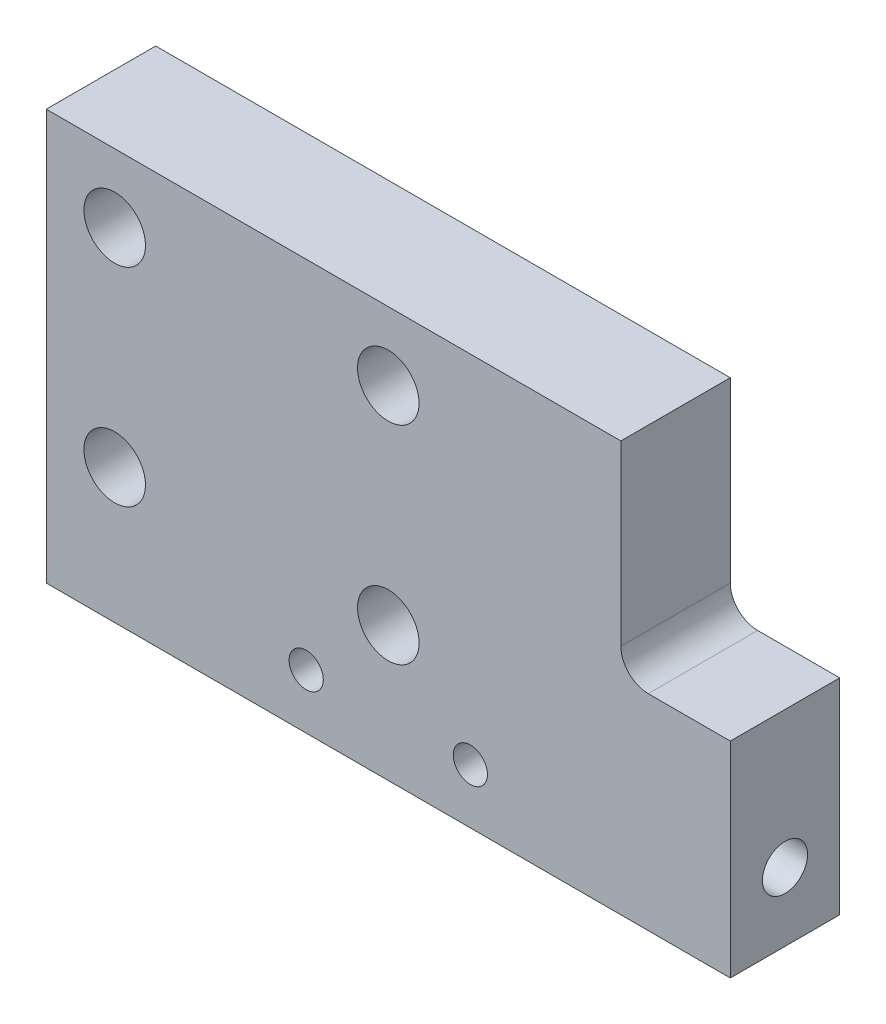
ISO-10303-21;
HEADER;
FILE_DESCRIPTION(('STEP AP214'),'2;1');
FILE_NAME('part.step','',(''),(''),'','','');
FILE_SCHEMA(('AUTOMOTIVE_DESIGN { 1 0 10303 214 1 1 1 1 }'));
ENDSEC;
DATA;
#1=APPLICATION_CONTEXT('core data for automotive mechanical design processes');
#2=APPLICATION_PROTOCOL_DEFINITION('international standard','automotive_design',2000,#1);
#3=PRODUCT_CONTEXT('',#1,'mechanical');
#4=PRODUCT('Part','Part','',(#3));
#5=PRODUCT_RELATED_PRODUCT_CATEGORY('part','',(#4));
#6=PRODUCT_DEFINITION_FORMATION('','',#4);
#7=PRODUCT_DEFINITION_CONTEXT('part definition',#1,'design');
#8=PRODUCT_DEFINITION('design','',#6,#7);
#9=PRODUCT_DEFINITION_SHAPE('','',#8);
#10=(LENGTH_UNIT() NAMED_UNIT(*) SI_UNIT(.MILLI.,.METRE.));
#11=(NAMED_UNIT(*) PLANE_ANGLE_UNIT() SI_UNIT($,.RADIAN.));
#12=(NAMED_UNIT(*) SI_UNIT($,.STERADIAN.) SOLID_ANGLE_UNIT());
#13=UNCERTAINTY_MEASURE_WITH_UNIT(LENGTH_MEASURE(1.E-05),#10,'distance_accuracy_value','');
#14=(GEOMETRIC_REPRESENTATION_CONTEXT(3) GLOBAL_UNCERTAINTY_ASSIGNED_CONTEXT((#13)) GLOBAL_UNIT_ASSIGNED_CONTEXT((#10,
#11,#12)) REPRESENTATION_CONTEXT('',''));
#15=CARTESIAN_POINT('',(0.,0.,0.));
#16=DIRECTION('',(0.,0.,1.));
#17=DIRECTION('',(1.,0.,0.));
#18=AXIS2_PLACEMENT_3D('',#15,#16,#17);
#19=CARTESIAN_POINT('',(0.,0.,8.));
#20=DIRECTION('',(0.,0.,1.));
#21=DIRECTION('',(1.,0.,0.));
#22=AXIS2_PLACEMENT_3D('',#19,#20,#21);
#23=PLANE('',#22);
#24=CARTESIAN_POINT('',(-2.62921348314607,-12.9662921348315,8.));
#25=DIRECTION('',(0.,0.,1.));
#26=DIRECTION('',(1.,0.,0.));
#27=AXIS2_PLACEMENT_3D('',#24,#25,#26);
#28=CIRCLE('',#27,1.25);
#29=CARTESIAN_POINT('',(-1.37921348314607,-12.9662921348315,8.));
#30=VERTEX_POINT('',#29);
#31=EDGE_CURVE('E119',#30,#30,#28,.T.);
#32=ORIENTED_EDGE('',*,*,#31,.F.);
#33=EDGE_LOOP('',(#32));
#34=FACE_BOUND('',#33,.T.);
#35=CARTESIAN_POINT('',(9.37078651685393,-12.9662921348315,8.));
#36=DIRECTION('',(0.,0.,1.));
#37=DIRECTION('',(1.,0.,0.));
#38=AXIS2_PLACEMENT_3D('',#35,#36,#37);
#39=CIRCLE('',#38,1.25);
#40=CARTESIAN_POINT('',(10.6207865168539,-12.9662921348315,8.));
#41=VERTEX_POINT('',#40);
#42=EDGE_CURVE('E126',#41,#41,#39,.T.);
#43=ORIENTED_EDGE('',*,*,#42,.F.);
#44=EDGE_LOOP('',(#43));
#45=FACE_BOUND('',#44,.T.);
#46=CARTESIAN_POINT('',(-16.6292134831461,-7.13483146067416,8.));
#47=DIRECTION('',(0.,0.,1.));
#48=DIRECTION('',(1.,0.,0.));
#49=AXIS2_PLACEMENT_3D('',#46,#47,#48);
#50=CIRCLE('',#49,2.25);
#51=CARTESIAN_POINT('',(-14.3792134831461,-7.13483146067416,8.));
#52=VERTEX_POINT('',#51);
#53=EDGE_CURVE('E140',#52,#52,#50,.T.);
#54=ORIENTED_EDGE('',*,*,#53,.F.);
#55=EDGE_LOOP('',(#54));
#56=FACE_BOUND('',#55,.T.);
#57=CARTESIAN_POINT('',(-16.6292134831461,8.03370786516854,8.));
#58=DIRECTION('',(0.,0.,1.));
#59=DIRECTION('',(1.,0.,0.));
#60=AXIS2_PLACEMENT_3D('',#57,#58,#59);
#61=CIRCLE('',#60,2.25);
#62=CARTESIAN_POINT('',(-14.3792134831461,8.03370786516854,8.));
#63=VERTEX_POINT('',#62);
#64=EDGE_CURVE('E152',#63,#63,#61,.T.);
#65=ORIENTED_EDGE('',*,*,#64,.F.);
#66=EDGE_LOOP('',(#65));
#67=FACE_BOUND('',#66,.T.);
#68=DIRECTION('',(0.,-1.,0.));
#69=VECTOR('',#68,1.);
#70=CARTESIAN_POINT('',(-21.6292134831461,13.0337078651685,8.));
#71=LINE('',#70,#69);
#72=CARTESIAN_POINT('',(-21.6292134831461,13.0337078651685,8.));
#73=VERTEX_POINT('',#72);
#74=CARTESIAN_POINT('',(-21.6292134831461,-16.9662921348315,8.));
#75=VERTEX_POINT('',#74);
#76=EDGE_CURVE('E158',#73,#75,#71,.T.);
#77=ORIENTED_EDGE('',*,*,#76,.T.);
#78=DIRECTION('',(1.,0.,0.));
#79=VECTOR('',#78,1.);
#80=CARTESIAN_POINT('',(-21.6292134831461,-16.9662921348315,8.));
#81=LINE('',#80,#79);
#82=CARTESIAN_POINT('',(28.3707865168539,-16.9662921348315,8.));
#83=VERTEX_POINT('',#82);
#84=EDGE_CURVE('E161',#75,#83,#81,.T.);
#85=ORIENTED_EDGE('',*,*,#84,.T.);
#86=DIRECTION('',(0.,1.,0.));
#87=VECTOR('',#86,1.);
#88=CARTESIAN_POINT('',(28.3707865168539,-1.96629213483146,8.));
#89=LINE('',#88,#87);
#90=CARTESIAN_POINT('',(28.3707865168539,-1.96629213483146,8.));
#91=VERTEX_POINT('',#90);
#92=EDGE_CURVE('E164',#83,#91,#89,.T.);
#93=ORIENTED_EDGE('',*,*,#92,.T.);
#94=DIRECTION('',(-1.,0.,0.));
#95=VECTOR('',#94,1.);
#96=CARTESIAN_POINT('',(20.3707865168539,-1.96629213483146,8.));
#97=LINE('',#96,#95);
#98=CARTESIAN_POINT('',(22.3707865168539,-1.96629213483146,8.));
#99=VERTEX_POINT('',#98);
#100=EDGE_CURVE('E166',#91,#99,#97,.T.);
#101=ORIENTED_EDGE('',*,*,#100,.T.);
#102=CARTESIAN_POINT('',(22.3707865168539,0.0337078651685401,8.));
#103=DIRECTION('',(0.,0.,1.));
#104=DIRECTION('',(1.,0.,0.));
#105=AXIS2_PLACEMENT_3D('',#102,#103,#104);
#106=CIRCLE('',#105,2.);
#107=CARTESIAN_POINT('',(20.3707865168539,0.0337078651685401,8.));
#108=VERTEX_POINT('',#107);
#109=EDGE_CURVE('E11',#99,#108,#106,.F.);
#110=ORIENTED_EDGE('',*,*,#109,.T.);
#111=DIRECTION('',(0.,1.,0.));
#112=VECTOR('',#111,1.);
#113=CARTESIAN_POINT('',(20.3707865168539,13.0337078651685,8.));
#114=LINE('',#113,#112);
#115=CARTESIAN_POINT('',(20.3707865168539,13.0337078651685,8.));
#116=VERTEX_POINT('',#115);
#117=EDGE_CURVE('E168',#108,#116,#114,.T.);
#118=ORIENTED_EDGE('',*,*,#117,.T.);
#119=DIRECTION('',(-1.,0.,0.));
#120=VECTOR('',#119,1.);
#121=CARTESIAN_POINT('',(-21.6292134831461,13.0337078651685,8.));
#122=LINE('',#121,#120);
#123=EDGE_CURVE('E170',#116,#73,#122,.T.);
#124=ORIENTED_EDGE('',*,*,#123,.T.);
#125=EDGE_LOOP('',(#77,#85,#93,#101,#110,#118,#124));
#126=FACE_BOUND('',#125,.T.);
#127=CARTESIAN_POINT('',(3.37078651685392,8.03370786516854,8.));
#128=DIRECTION('',(0.,0.,1.));
#129=DIRECTION('',(1.,0.,0.));
#130=AXIS2_PLACEMENT_3D('',#127,#128,#129);
#131=CIRCLE('',#130,2.25);
#132=CARTESIAN_POINT('',(5.62078651685392,8.03370786516854,8.));
#133=VERTEX_POINT('',#132);
#134=EDGE_CURVE('E146',#133,#133,#131,.T.);
#135=ORIENTED_EDGE('',*,*,#134,.F.);
#136=EDGE_LOOP('',(#135));
#137=FACE_BOUND('',#136,.T.);
#138=CARTESIAN_POINT('',(3.37078651685392,-7.13483146067416,8.));
#139=DIRECTION('',(0.,0.,1.));
#140=DIRECTION('',(1.,0.,0.));
#141=AXIS2_PLACEMENT_3D('',#138,#139,#140);
#142=CIRCLE('',#141,2.25);
#143=CARTESIAN_POINT('',(5.62078651685392,-7.13483146067416,8.));
#144=VERTEX_POINT('',#143);
#145=EDGE_CURVE('E133',#144,#144,#142,.T.);
#146=ORIENTED_EDGE('',*,*,#145,.F.);
#147=EDGE_LOOP('',(#146));
#148=FACE_BOUND('',#147,.T.);
#149=ADVANCED_FACE('F35',(#34,#45,#56,#67,#126,#137,#148),#23,.T.);
#150=CARTESIAN_POINT('',(0.,0.,0.));
#151=DIRECTION('',(0.,0.,1.));
#152=DIRECTION('',(1.,0.,0.));
#153=AXIS2_PLACEMENT_3D('',#150,#151,#152);
#154=PLANE('',#153);
#155=CARTESIAN_POINT('',(-2.62921348314607,-12.9662921348315,0.));
#156=DIRECTION('',(0.,0.,1.));
#157=DIRECTION('',(1.,0.,0.));
#158=AXIS2_PLACEMENT_3D('',#155,#156,#157);
#159=CIRCLE('',#158,0.41786025882474);
#160=CARTESIAN_POINT('',(-2.21135322432133,-12.9662921348315,0.));
#161=VERTEX_POINT('',#160);
#162=EDGE_CURVE('E125',#161,#161,#159,.T.);
#163=ORIENTED_EDGE('',*,*,#162,.T.);
#164=EDGE_LOOP('',(#163));
#165=FACE_BOUND('',#164,.T.);
#166=CARTESIAN_POINT('',(9.37078651685393,-12.9662921348315,0.));
#167=DIRECTION('',(0.,0.,1.));
#168=DIRECTION('',(1.,0.,0.));
#169=AXIS2_PLACEMENT_3D('',#166,#167,#168);
#170=CIRCLE('',#169,0.41786025882474);
#171=CARTESIAN_POINT('',(9.78864677567867,-12.9662921348315,0.));
#172=VERTEX_POINT('',#171);
#173=EDGE_CURVE('E132',#172,#172,#170,.T.);
#174=ORIENTED_EDGE('',*,*,#173,.T.);
#175=EDGE_LOOP('',(#174));
#176=FACE_BOUND('',#175,.T.);
#177=DIRECTION('',(0.,-1.,0.));
#178=VECTOR('',#177,1.);
#179=CARTESIAN_POINT('',(-21.6292134831461,13.0337078651685,0.));
#180=LINE('',#179,#178);
#181=CARTESIAN_POINT('',(-21.6292134831461,13.0337078651685,0.));
#182=VERTEX_POINT('',#181);
#183=CARTESIAN_POINT('',(-21.6292134831461,-16.9662921348315,0.));
#184=VERTEX_POINT('',#183);
#185=EDGE_CURVE('E155',#182,#184,#180,.T.);
#186=ORIENTED_EDGE('',*,*,#185,.F.);
#187=DIRECTION('',(-1.,0.,0.));
#188=VECTOR('',#187,1.);
#189=CARTESIAN_POINT('',(-21.6292134831461,13.0337078651685,0.));
#190=LINE('',#189,#188);
#191=CARTESIAN_POINT('',(20.3707865168539,13.0337078651685,0.));
#192=VERTEX_POINT('',#191);
#193=EDGE_CURVE('E162',#192,#182,#190,.T.);
#194=ORIENTED_EDGE('',*,*,#193,.F.);
#195=DIRECTION('',(0.,1.,0.));
#196=VECTOR('',#195,1.);
#197=CARTESIAN_POINT('',(20.3707865168539,13.0337078651685,0.));
#198=LINE('',#197,#196);
#199=CARTESIAN_POINT('',(20.3707865168539,0.0337078651685401,0.));
#200=VERTEX_POINT('',#199);
#201=EDGE_CURVE('E181',#200,#192,#198,.T.);
#202=ORIENTED_EDGE('',*,*,#201,.F.);
#203=CARTESIAN_POINT('',(22.3707865168539,0.0337078651685401,0.));
#204=DIRECTION('',(0.,0.,1.));
#205=DIRECTION('',(1.,0.,0.));
#206=AXIS2_PLACEMENT_3D('',#203,#204,#205);
#207=CIRCLE('',#206,2.);
#208=CARTESIAN_POINT('',(22.3707865168539,-1.96629213483146,0.));
#209=VERTEX_POINT('',#208);
#210=EDGE_CURVE('E43',#200,#209,#207,.T.);
#211=ORIENTED_EDGE('',*,*,#210,.T.);
#212=DIRECTION('',(-1.,0.,0.));
#213=VECTOR('',#212,1.);
#214=CARTESIAN_POINT('',(20.3707865168539,-1.96629213483146,0.));
#215=LINE('',#214,#213);
#216=CARTESIAN_POINT('',(28.3707865168539,-1.96629213483146,0.));
#217=VERTEX_POINT('',#216);
#218=EDGE_CURVE('E179',#217,#209,#215,.T.);
#219=ORIENTED_EDGE('',*,*,#218,.F.);
#220=DIRECTION('',(0.,1.,0.));
#221=VECTOR('',#220,1.);
#222=CARTESIAN_POINT('',(28.3707865168539,-1.96629213483146,0.));
#223=LINE('',#222,#221);
#224=CARTESIAN_POINT('',(28.3707865168539,-16.9662921348315,0.));
#225=VERTEX_POINT('',#224);
#226=EDGE_CURVE('E177',#225,#217,#223,.T.);
#227=ORIENTED_EDGE('',*,*,#226,.F.);
#228=DIRECTION('',(1.,0.,0.));
#229=VECTOR('',#228,1.);
#230=CARTESIAN_POINT('',(-21.6292134831461,-16.9662921348315,0.));
#231=LINE('',#230,#229);
#232=EDGE_CURVE('E175',#184,#225,#231,.T.);
#233=ORIENTED_EDGE('',*,*,#232,.F.);
#234=EDGE_LOOP('',(#186,#194,#202,#211,#219,#227,#233));
#235=FACE_BOUND('',#234,.T.);
#236=CARTESIAN_POINT('',(-16.6292134831461,8.03370786516854,0.));
#237=DIRECTION('',(0.,0.,1.));
#238=DIRECTION('',(1.,0.,0.));
#239=AXIS2_PLACEMENT_3D('',#236,#237,#238);
#240=CIRCLE('',#239,2.25);
#241=CARTESIAN_POINT('',(-14.3792134831461,8.03370786516854,0.));
#242=VERTEX_POINT('',#241);
#243=EDGE_CURVE('E149',#242,#242,#240,.T.);
#244=ORIENTED_EDGE('',*,*,#243,.T.);
#245=EDGE_LOOP('',(#244));
#246=FACE_BOUND('',#245,.T.);
#247=CARTESIAN_POINT('',(3.37078651685392,8.03370786516854,0.));
#248=DIRECTION('',(0.,0.,1.));
#249=DIRECTION('',(1.,0.,0.));
#250=AXIS2_PLACEMENT_3D('',#247,#248,#249);
#251=CIRCLE('',#250,2.25);
#252=CARTESIAN_POINT('',(5.62078651685392,8.03370786516854,0.));
#253=VERTEX_POINT('',#252);
#254=EDGE_CURVE('E143',#253,#253,#251,.T.);
#255=ORIENTED_EDGE('',*,*,#254,.T.);
#256=EDGE_LOOP('',(#255));
#257=FACE_BOUND('',#256,.T.);
#258=CARTESIAN_POINT('',(-16.6292134831461,-7.13483146067416,0.));
#259=DIRECTION('',(0.,0.,1.));
#260=DIRECTION('',(1.,0.,0.));
#261=AXIS2_PLACEMENT_3D('',#258,#259,#260);
#262=CIRCLE('',#261,2.25);
#263=CARTESIAN_POINT('',(-14.3792134831461,-7.13483146067416,0.));
#264=VERTEX_POINT('',#263);
#265=EDGE_CURVE('E136',#264,#264,#262,.T.);
#266=ORIENTED_EDGE('',*,*,#265,.T.);
#267=EDGE_LOOP('',(#266));
#268=FACE_BOUND('',#267,.T.);
#269=CARTESIAN_POINT('',(3.37078651685392,-7.13483146067416,0.));
#270=DIRECTION('',(0.,0.,1.));
#271=DIRECTION('',(1.,0.,0.));
#272=AXIS2_PLACEMENT_3D('',#269,#270,#271);
#273=CIRCLE('',#272,2.25);
#274=CARTESIAN_POINT('',(5.62078651685392,-7.13483146067416,0.));
#275=VERTEX_POINT('',#274);
#276=EDGE_CURVE('E137',#275,#275,#273,.T.);
#277=ORIENTED_EDGE('',*,*,#276,.T.);
#278=EDGE_LOOP('',(#277));
#279=FACE_BOUND('',#278,.T.);
#280=ADVANCED_FACE('F214',(#165,#176,#235,#246,#257,#268,#279),#154,.F.);
#281=CARTESIAN_POINT('',(-21.6292134831461,13.0337078651685,8.));
#282=DIRECTION('',(1.,0.,0.));
#283=DIRECTION('',(0.,1.,0.));
#284=AXIS2_PLACEMENT_3D('',#281,#282,#283);
#285=PLANE('',#284);
#286=CARTESIAN_POINT('',(-21.6292134831461,-11.9662921348315,4.));
#287=DIRECTION('',(-1.,0.,0.));
#288=DIRECTION('',(0.,0.,1.));
#289=AXIS2_PLACEMENT_3D('',#286,#287,#288);
#290=CIRCLE('',#289,1.64999999999999);
#291=CARTESIAN_POINT('',(-21.6292134831461,-11.9662921348315,5.64999999999999));
#292=VERTEX_POINT('',#291);
#293=EDGE_CURVE('E109',#292,#292,#290,.T.);
#294=ORIENTED_EDGE('',*,*,#293,.F.);
#295=EDGE_LOOP('',(#294));
#296=FACE_BOUND('',#295,.T.);
#297=ORIENTED_EDGE('',*,*,#185,.T.);
#298=DIRECTION('',(0.,0.,-1.));
#299=VECTOR('',#298,1.);
#300=CARTESIAN_POINT('',(-21.6292134831461,-16.9662921348315,8.));
#301=LINE('',#300,#299);
#302=EDGE_CURVE('E195',#75,#184,#301,.T.);
#303=ORIENTED_EDGE('',*,*,#302,.F.);
#304=ORIENTED_EDGE('',*,*,#76,.F.);
#305=DIRECTION('',(0.,0.,-1.));
#306=VECTOR('',#305,1.);
#307=CARTESIAN_POINT('',(-21.6292134831461,13.0337078651685,8.));
#308=LINE('',#307,#306);
#309=EDGE_CURVE('E172',#73,#182,#308,.T.);
#310=ORIENTED_EDGE('',*,*,#309,.T.);
#311=EDGE_LOOP('',(#297,#303,#304,#310));
#312=FACE_BOUND('',#311,.T.);
#313=ADVANCED_FACE('F222',(#296,#312),#285,.F.);
#314=CARTESIAN_POINT('',(-21.6292134831461,-16.9662921348315,8.));
#315=DIRECTION('',(0.,1.,0.));
#316=DIRECTION('',(0.,0.,1.));
#317=AXIS2_PLACEMENT_3D('',#314,#315,#316);
#318=PLANE('',#317);
#319=ORIENTED_EDGE('',*,*,#232,.T.);
#320=DIRECTION('',(0.,0.,-1.));
#321=VECTOR('',#320,1.);
#322=CARTESIAN_POINT('',(28.3707865168539,-16.9662921348315,8.));
#323=LINE('',#322,#321);
#324=EDGE_CURVE('E192',#83,#225,#323,.T.);
#325=ORIENTED_EDGE('',*,*,#324,.F.);
#326=ORIENTED_EDGE('',*,*,#84,.F.);
#327=ORIENTED_EDGE('',*,*,#302,.T.);
#328=EDGE_LOOP('',(#319,#325,#326,#327));
#329=FACE_BOUND('',#328,.T.);
#330=ADVANCED_FACE('F256',(#329),#318,.F.);
#331=CARTESIAN_POINT('',(28.3707865168539,-1.96629213483146,8.));
#332=DIRECTION('',(-1.,0.,0.));
#333=DIRECTION('',(0.,-1.,0.));
#334=AXIS2_PLACEMENT_3D('',#331,#332,#333);
#335=PLANE('',#334);
#336=CARTESIAN_POINT('',(28.3707865168539,-11.9662921348315,4.));
#337=DIRECTION('',(1.,0.,0.));
#338=DIRECTION('',(0.,0.,-1.));
#339=AXIS2_PLACEMENT_3D('',#336,#337,#338);
#340=CIRCLE('',#339,1.65);
#341=CARTESIAN_POINT('',(28.3707865168539,-11.9662921348315,2.35));
#342=VERTEX_POINT('',#341);
#343=EDGE_CURVE('E108',#342,#342,#340,.T.);
#344=ORIENTED_EDGE('',*,*,#343,.F.);
#345=EDGE_LOOP('',(#344));
#346=FACE_BOUND('',#345,.T.);
#347=ORIENTED_EDGE('',*,*,#226,.T.);
#348=DIRECTION('',(0.,0.,-1.));
#349=VECTOR('',#348,1.);
#350=CARTESIAN_POINT('',(28.3707865168539,-1.96629213483146,8.));
#351=LINE('',#350,#349);
#352=EDGE_CURVE('E189',#91,#217,#351,.T.);
#353=ORIENTED_EDGE('',*,*,#352,.F.);
#354=ORIENTED_EDGE('',*,*,#92,.F.);
#355=ORIENTED_EDGE('',*,*,#324,.T.);
#356=EDGE_LOOP('',(#347,#353,#354,#355));
#357=FACE_BOUND('',#356,.T.);
#358=ADVANCED_FACE('F253',(#346,#357),#335,.F.);
#359=CARTESIAN_POINT('',(20.3707865168539,-1.96629213483146,8.));
#360=DIRECTION('',(0.,-1.,0.));
#361=DIRECTION('',(1.,0.,0.));
#362=AXIS2_PLACEMENT_3D('',#359,#360,#361);
#363=PLANE('',#362);
#364=ORIENTED_EDGE('',*,*,#218,.T.);
#365=DIRECTION('',(0.,0.,-1.));
#366=VECTOR('',#365,1.);
#367=CARTESIAN_POINT('',(22.3707865168539,-1.96629213483146,8.));
#368=LINE('',#367,#366);
#369=EDGE_CURVE('E50',#209,#99,#368,.F.);
#370=ORIENTED_EDGE('',*,*,#369,.T.);
#371=ORIENTED_EDGE('',*,*,#100,.F.);
#372=ORIENTED_EDGE('',*,*,#352,.T.);
#373=EDGE_LOOP('',(#364,#370,#371,#372));
#374=FACE_BOUND('',#373,.T.);
#375=ADVANCED_FACE('F250',(#374),#363,.F.);
#376=CARTESIAN_POINT('',(20.3707865168539,13.0337078651685,8.));
#377=DIRECTION('',(-1.,0.,0.));
#378=DIRECTION('',(0.,0.,1.));
#379=AXIS2_PLACEMENT_3D('',#376,#377,#378);
#380=PLANE('',#379);
#381=ORIENTED_EDGE('',*,*,#117,.F.);
#382=DIRECTION('',(0.,0.,-1.));
#383=VECTOR('',#382,1.);
#384=CARTESIAN_POINT('',(20.3707865168539,0.0337078651685401,0.));
#385=LINE('',#384,#383);
#386=EDGE_CURVE('E198',#108,#200,#385,.T.);
#387=ORIENTED_EDGE('',*,*,#386,.T.);
#388=ORIENTED_EDGE('',*,*,#201,.T.);
#389=DIRECTION('',(0.,0.,-1.));
#390=VECTOR('',#389,1.);
#391=CARTESIAN_POINT('',(20.3707865168539,13.0337078651685,8.));
#392=LINE('',#391,#390);
#393=EDGE_CURVE('E186',#116,#192,#392,.T.);
#394=ORIENTED_EDGE('',*,*,#393,.F.);
#395=EDGE_LOOP('',(#381,#387,#388,#394));
#396=FACE_BOUND('',#395,.T.);
#397=ADVANCED_FACE('F208',(#396),#380,.F.);
#398=CARTESIAN_POINT('',(-21.6292134831461,13.0337078651685,8.));
#399=DIRECTION('',(0.,-1.,0.));
#400=DIRECTION('',(0.,0.,-1.));
#401=AXIS2_PLACEMENT_3D('',#398,#399,#400);
#402=PLANE('',#401);
#403=ORIENTED_EDGE('',*,*,#193,.T.);
#404=ORIENTED_EDGE('',*,*,#309,.F.);
#405=ORIENTED_EDGE('',*,*,#123,.F.);
#406=ORIENTED_EDGE('',*,*,#393,.T.);
#407=EDGE_LOOP('',(#403,#404,#405,#406));
#408=FACE_BOUND('',#407,.T.);
#409=ADVANCED_FACE('F218',(#408),#402,.F.);
#410=CARTESIAN_POINT('',(-16.6292134831461,8.03370786516854,8.));
#411=DIRECTION('',(0.,0.,-1.));
#412=DIRECTION('',(-1.,0.,0.));
#413=AXIS2_PLACEMENT_3D('',#410,#411,#412);
#414=CYLINDRICAL_SURFACE('',#413,2.25);
#415=ORIENTED_EDGE('',*,*,#64,.T.);
#416=EDGE_LOOP('',(#415));
#417=FACE_BOUND('',#416,.T.);
#418=ORIENTED_EDGE('',*,*,#243,.F.);
#419=EDGE_LOOP('',(#418));
#420=FACE_BOUND('',#419,.T.);
#421=ADVANCED_FACE('F243',(#417,#420),#414,.F.);
#422=CARTESIAN_POINT('',(3.37078651685392,8.03370786516854,8.));
#423=DIRECTION('',(0.,0.,-1.));
#424=DIRECTION('',(-1.,0.,0.));
#425=AXIS2_PLACEMENT_3D('',#422,#423,#424);
#426=CYLINDRICAL_SURFACE('',#425,2.25);
#427=ORIENTED_EDGE('',*,*,#134,.T.);
#428=EDGE_LOOP('',(#427));
#429=FACE_BOUND('',#428,.T.);
#430=ORIENTED_EDGE('',*,*,#254,.F.);
#431=EDGE_LOOP('',(#430));
#432=FACE_BOUND('',#431,.T.);
#433=ADVANCED_FACE('F298',(#429,#432),#426,.F.);
#434=CARTESIAN_POINT('',(-16.6292134831461,-7.13483146067416,8.));
#435=DIRECTION('',(0.,0.,-1.));
#436=DIRECTION('',(-1.,0.,0.));
#437=AXIS2_PLACEMENT_3D('',#434,#435,#436);
#438=CYLINDRICAL_SURFACE('',#437,2.25);
#439=ORIENTED_EDGE('',*,*,#53,.T.);
#440=EDGE_LOOP('',(#439));
#441=FACE_BOUND('',#440,.T.);
#442=ORIENTED_EDGE('',*,*,#265,.F.);
#443=EDGE_LOOP('',(#442));
#444=FACE_BOUND('',#443,.T.);
#445=ADVANCED_FACE('F305',(#441,#444),#438,.F.);
#446=CARTESIAN_POINT('',(3.37078651685392,-7.13483146067416,8.));
#447=DIRECTION('',(0.,0.,-1.));
#448=DIRECTION('',(-1.,0.,0.));
#449=AXIS2_PLACEMENT_3D('',#446,#447,#448);
#450=CYLINDRICAL_SURFACE('',#449,2.25);
#451=ORIENTED_EDGE('',*,*,#145,.T.);
#452=EDGE_LOOP('',(#451));
#453=FACE_BOUND('',#452,.T.);
#454=ORIENTED_EDGE('',*,*,#276,.F.);
#455=EDGE_LOOP('',(#454));
#456=FACE_BOUND('',#455,.T.);
#457=ADVANCED_FACE('F312',(#453,#456),#450,.F.);
#458=CARTESIAN_POINT('',(9.37078651685393,-12.9662921348315,0.5));
#459=DIRECTION('',(0.,0.,1.));
#460=DIRECTION('',(1.,0.,0.));
#461=AXIS2_PLACEMENT_3D('',#458,#459,#460);
#462=CONICAL_SURFACE('',#461,1.25,1.02974425867665);
#463=CARTESIAN_POINT('',(9.37078651685393,-12.9662921348315,0.5));
#464=DIRECTION('',(0.,0.,1.));
#465=DIRECTION('',(1.,0.,0.));
#466=AXIS2_PLACEMENT_3D('',#463,#464,#465);
#467=CIRCLE('',#466,1.25);
#468=CARTESIAN_POINT('',(10.6207865168539,-12.9662921348315,0.5));
#469=VERTEX_POINT('',#468);
#470=EDGE_CURVE('E129',#469,#469,#467,.T.);
#471=ORIENTED_EDGE('',*,*,#470,.T.);
#472=EDGE_LOOP('',(#471));
#473=FACE_BOUND('',#472,.T.);
#474=ORIENTED_EDGE('',*,*,#173,.F.);
#475=EDGE_LOOP('',(#474));
#476=FACE_BOUND('',#475,.T.);
#477=ADVANCED_FACE('F320',(#473,#476),#462,.F.);
#478=CARTESIAN_POINT('',(9.37078651685393,-12.9662921348315,8.));
#479=DIRECTION('',(0.,0.,1.));
#480=DIRECTION('',(1.,0.,0.));
#481=AXIS2_PLACEMENT_3D('',#478,#479,#480);
#482=CYLINDRICAL_SURFACE('',#481,1.25);
#483=ORIENTED_EDGE('',*,*,#470,.F.);
#484=EDGE_LOOP('',(#483));
#485=FACE_BOUND('',#484,.T.);
#486=ORIENTED_EDGE('',*,*,#42,.T.);
#487=EDGE_LOOP('',(#486));
#488=FACE_BOUND('',#487,.T.);
#489=ADVANCED_FACE('F328',(#485,#488),#482,.F.);
#490=CARTESIAN_POINT('',(-2.62921348314607,-12.9662921348315,0.5));
#491=DIRECTION('',(0.,0.,1.));
#492=DIRECTION('',(1.,0.,0.));
#493=AXIS2_PLACEMENT_3D('',#490,#491,#492);
#494=CONICAL_SURFACE('',#493,1.25,1.02974425867665);
#495=CARTESIAN_POINT('',(-2.62921348314607,-12.9662921348315,0.5));
#496=DIRECTION('',(0.,0.,1.));
#497=DIRECTION('',(1.,0.,0.));
#498=AXIS2_PLACEMENT_3D('',#495,#496,#497);
#499=CIRCLE('',#498,1.25);
#500=CARTESIAN_POINT('',(-1.37921348314607,-12.9662921348315,0.5));
#501=VERTEX_POINT('',#500);
#502=EDGE_CURVE('E122',#501,#501,#499,.T.);
#503=ORIENTED_EDGE('',*,*,#502,.T.);
#504=EDGE_LOOP('',(#503));
#505=FACE_BOUND('',#504,.T.);
#506=ORIENTED_EDGE('',*,*,#162,.F.);
#507=EDGE_LOOP('',(#506));
#508=FACE_BOUND('',#507,.T.);
#509=ADVANCED_FACE('F337',(#505,#508),#494,.F.);
#510=CARTESIAN_POINT('',(-2.62921348314607,-12.9662921348315,8.));
#511=DIRECTION('',(0.,0.,1.));
#512=DIRECTION('',(1.,0.,0.));
#513=AXIS2_PLACEMENT_3D('',#510,#511,#512);
#514=CYLINDRICAL_SURFACE('',#513,1.25);
#515=ORIENTED_EDGE('',*,*,#502,.F.);
#516=EDGE_LOOP('',(#515));
#517=FACE_BOUND('',#516,.T.);
#518=ORIENTED_EDGE('',*,*,#31,.T.);
#519=EDGE_LOOP('',(#518));
#520=FACE_BOUND('',#519,.T.);
#521=ADVANCED_FACE('F346',(#517,#520),#514,.F.);
#522=CARTESIAN_POINT('',(20.3707865168539,-11.9662921348315,4.));
#523=DIRECTION('',(1.,0.,0.));
#524=DIRECTION('',(0.,0.,-1.));
#525=AXIS2_PLACEMENT_3D('',#522,#523,#524);
#526=CONICAL_SURFACE('',#525,1.65,1.02974425867665);
#527=CARTESIAN_POINT('',(19.3793664954585,-11.9662921348315,4.));
#528=VERTEX_POINT('',#527);
#529=VERTEX_LOOP('',#528);
#530=FACE_BOUND('',#529,.T.);
#531=CARTESIAN_POINT('',(20.3707865168539,-11.9662921348315,4.));
#532=DIRECTION('',(1.,0.,0.));
#533=DIRECTION('',(0.,0.,-1.));
#534=AXIS2_PLACEMENT_3D('',#531,#532,#533);
#535=CIRCLE('',#534,1.65);
#536=CARTESIAN_POINT('',(20.3707865168539,-11.9662921348315,2.35));
#537=VERTEX_POINT('',#536);
#538=EDGE_CURVE('E112',#537,#537,#535,.T.);
#539=ORIENTED_EDGE('',*,*,#538,.T.);
#540=EDGE_LOOP('',(#539));
#541=FACE_BOUND('',#540,.T.);
#542=ADVANCED_FACE('F353',(#530,#541),#526,.F.);
#543=CARTESIAN_POINT('',(28.3707865168539,-11.9662921348315,4.));
#544=DIRECTION('',(1.,0.,0.));
#545=DIRECTION('',(0.,0.,-1.));
#546=AXIS2_PLACEMENT_3D('',#543,#544,#545);
#547=CYLINDRICAL_SURFACE('',#546,1.65);
#548=ORIENTED_EDGE('',*,*,#538,.F.);
#549=EDGE_LOOP('',(#548));
#550=FACE_BOUND('',#549,.T.);
#551=ORIENTED_EDGE('',*,*,#343,.T.);
#552=EDGE_LOOP('',(#551));
#553=FACE_BOUND('',#552,.T.);
#554=ADVANCED_FACE('F102',(#550,#553),#547,.F.);
#555=CARTESIAN_POINT('',(-13.6292134831461,-11.9662921348315,4.));
#556=DIRECTION('',(-1.,0.,0.));
#557=DIRECTION('',(0.,0.,1.));
#558=AXIS2_PLACEMENT_3D('',#555,#556,#557);
#559=CONICAL_SURFACE('',#558,1.65,1.02974425867665);
#560=CARTESIAN_POINT('',(-12.6377934617506,-11.9662921348315,4.));
#561=VERTEX_POINT('',#560);
#562=VERTEX_LOOP('',#561);
#563=FACE_BOUND('',#562,.T.);
#564=CARTESIAN_POINT('',(-13.6292134831461,-11.9662921348315,4.));
#565=DIRECTION('',(-1.,0.,0.));
#566=DIRECTION('',(0.,0.,1.));
#567=AXIS2_PLACEMENT_3D('',#564,#565,#566);
#568=CIRCLE('',#567,1.65);
#569=CARTESIAN_POINT('',(-13.6292134831461,-11.9662921348315,5.65));
#570=VERTEX_POINT('',#569);
#571=EDGE_CURVE('E106',#570,#570,#568,.T.);
#572=ORIENTED_EDGE('',*,*,#571,.T.);
#573=EDGE_LOOP('',(#572));
#574=FACE_BOUND('',#573,.T.);
#575=ADVANCED_FACE('F98',(#563,#574),#559,.F.);
#576=CARTESIAN_POINT('',(-21.6292134831461,-11.9662921348315,4.));
#577=DIRECTION('',(-1.,0.,0.));
#578=DIRECTION('',(0.,0.,1.));
#579=AXIS2_PLACEMENT_3D('',#576,#577,#578);
#580=CYLINDRICAL_SURFACE('',#579,1.64999999999999);
#581=ORIENTED_EDGE('',*,*,#571,.F.);
#582=EDGE_LOOP('',(#581));
#583=FACE_BOUND('',#582,.T.);
#584=ORIENTED_EDGE('',*,*,#293,.T.);
#585=EDGE_LOOP('',(#584));
#586=FACE_BOUND('',#585,.T.);
#587=ADVANCED_FACE('F101',(#583,#586),#580,.F.);
#588=CARTESIAN_POINT('',(22.3707865168539,0.0337078651685401,8.));
#589=DIRECTION('',(0.,0.,1.));
#590=DIRECTION('',(1.,0.,0.));
#591=AXIS2_PLACEMENT_3D('',#588,#589,#590);
#592=CYLINDRICAL_SURFACE('',#591,2.);
#593=ORIENTED_EDGE('',*,*,#109,.F.);
#594=ORIENTED_EDGE('',*,*,#369,.F.);
#595=ORIENTED_EDGE('',*,*,#210,.F.);
#596=ORIENTED_EDGE('',*,*,#386,.F.);
#597=EDGE_LOOP('',(#593,#594,#595,#596));
#598=FACE_BOUND('',#597,.T.);
#599=ADVANCED_FACE('F37',(#598),#592,.F.);
#600=CLOSED_SHELL('',(#149,#280,#313,#330,#358,#375,#397,#409,#421,#433,#445,#457,#477,#489,
#509,#521,#542,#554,#575,#587,#599));
#601=MANIFOLD_SOLID_BREP('B2',#600);
#602=ADVANCED_BREP_SHAPE_REPRESENTATION('',(#18,#601),#14);
#603=SHAPE_DEFINITION_REPRESENTATION(#9,#602);
ENDSEC;
END-ISO-10303-21;
